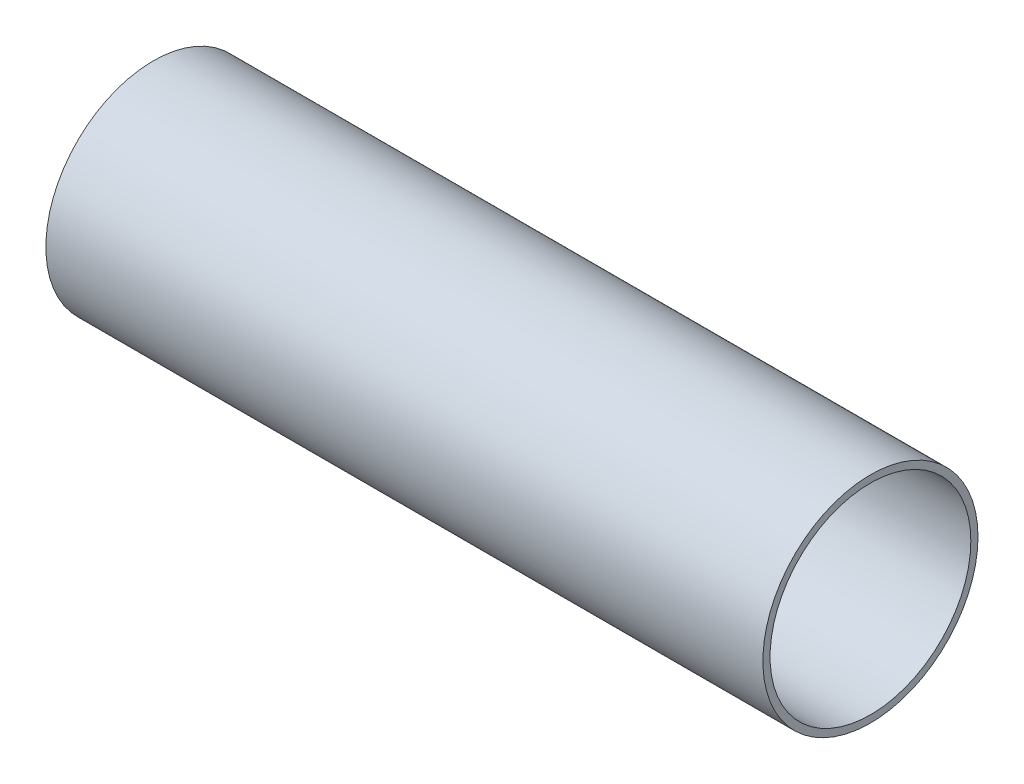
ISO-10303-21;
HEADER;
FILE_DESCRIPTION(('STEP AP214'),'2;1');
FILE_NAME('part.step','',(''),(''),'','','');
FILE_SCHEMA(('AUTOMOTIVE_DESIGN { 1 0 10303 214 1 1 1 1 }'));
ENDSEC;
DATA;
#1=APPLICATION_CONTEXT('core data for automotive mechanical design processes');
#2=APPLICATION_PROTOCOL_DEFINITION('international standard','automotive_design',2000,#1);
#3=PRODUCT_CONTEXT('',#1,'mechanical');
#4=PRODUCT('Part','Part','',(#3));
#5=PRODUCT_RELATED_PRODUCT_CATEGORY('part','',(#4));
#6=PRODUCT_DEFINITION_FORMATION('','',#4);
#7=PRODUCT_DEFINITION_CONTEXT('part definition',#1,'design');
#8=PRODUCT_DEFINITION('design','',#6,#7);
#9=PRODUCT_DEFINITION_SHAPE('','',#8);
#10=(LENGTH_UNIT() NAMED_UNIT(*) SI_UNIT(.MILLI.,.METRE.));
#11=(NAMED_UNIT(*) PLANE_ANGLE_UNIT() SI_UNIT($,.RADIAN.));
#12=(NAMED_UNIT(*) SI_UNIT($,.STERADIAN.) SOLID_ANGLE_UNIT());
#13=UNCERTAINTY_MEASURE_WITH_UNIT(LENGTH_MEASURE(1.E-05),#10,'distance_accuracy_value','');
#14=(GEOMETRIC_REPRESENTATION_CONTEXT(3) GLOBAL_UNCERTAINTY_ASSIGNED_CONTEXT((#13)) GLOBAL_UNIT_ASSIGNED_CONTEXT((#10,
#11,#12)) REPRESENTATION_CONTEXT('',''));
#15=CARTESIAN_POINT('',(0.,0.,0.));
#16=DIRECTION('',(0.,0.,1.));
#17=DIRECTION('',(1.,0.,0.));
#18=AXIS2_PLACEMENT_3D('',#15,#16,#17);
#19=CARTESIAN_POINT('',(200.,0.,0.));
#20=DIRECTION('',(-1.,0.,0.));
#21=DIRECTION('',(0.,0.,1.));
#22=AXIS2_PLACEMENT_3D('',#19,#20,#21);
#23=CYLINDRICAL_SURFACE('',#22,30.);
#24=CARTESIAN_POINT('',(200.,0.,0.));
#25=DIRECTION('',(1.,0.,0.));
#26=DIRECTION('',(0.,0.,-1.));
#27=AXIS2_PLACEMENT_3D('',#24,#25,#26);
#28=CIRCLE('',#27,30.);
#29=CARTESIAN_POINT('',(200.,0.,-30.));
#30=VERTEX_POINT('',#29);
#31=EDGE_CURVE('E10',#30,#30,#28,.T.);
#32=ORIENTED_EDGE('',*,*,#31,.F.);
#33=EDGE_LOOP('',(#32));
#34=FACE_BOUND('',#33,.T.);
#35=CARTESIAN_POINT('',(0.,0.,0.));
#36=DIRECTION('',(1.,0.,0.));
#37=DIRECTION('',(0.,0.,-1.));
#38=AXIS2_PLACEMENT_3D('',#35,#36,#37);
#39=CIRCLE('',#38,30.);
#40=CARTESIAN_POINT('',(0.,0.,-30.));
#41=VERTEX_POINT('',#40);
#42=EDGE_CURVE('E36',#41,#41,#39,.T.);
#43=ORIENTED_EDGE('',*,*,#42,.T.);
#44=EDGE_LOOP('',(#43));
#45=FACE_BOUND('',#44,.T.);
#46=ADVANCED_FACE('F33',(#34,#45),#23,.T.);
#47=CARTESIAN_POINT('',(200.,0.,0.));
#48=DIRECTION('',(1.,0.,0.));
#49=DIRECTION('',(0.,0.,-1.));
#50=AXIS2_PLACEMENT_3D('',#47,#48,#49);
#51=PLANE('',#50);
#52=CARTESIAN_POINT('',(200.,0.,0.));
#53=DIRECTION('',(1.,0.,0.));
#54=DIRECTION('',(0.,0.,-1.));
#55=AXIS2_PLACEMENT_3D('',#52,#53,#54);
#56=CIRCLE('',#55,28.);
#57=CARTESIAN_POINT('',(200.,0.,-28.));
#58=VERTEX_POINT('',#57);
#59=EDGE_CURVE('E45',#58,#58,#56,.T.);
#60=ORIENTED_EDGE('',*,*,#59,.F.);
#61=EDGE_LOOP('',(#60));
#62=FACE_BOUND('',#61,.T.);
#63=ORIENTED_EDGE('',*,*,#31,.T.);
#64=EDGE_LOOP('',(#63));
#65=FACE_BOUND('',#64,.T.);
#66=ADVANCED_FACE('F60',(#62,#65),#51,.T.);
#67=CARTESIAN_POINT('',(0.,0.,0.));
#68=DIRECTION('',(1.,0.,0.));
#69=DIRECTION('',(0.,0.,-1.));
#70=AXIS2_PLACEMENT_3D('',#67,#68,#69);
#71=PLANE('',#70);
#72=CARTESIAN_POINT('',(0.,0.,0.));
#73=DIRECTION('',(1.,0.,0.));
#74=DIRECTION('',(0.,0.,-1.));
#75=AXIS2_PLACEMENT_3D('',#72,#73,#74);
#76=CIRCLE('',#75,28.);
#77=CARTESIAN_POINT('',(0.,0.,-28.));
#78=VERTEX_POINT('',#77);
#79=EDGE_CURVE('E43',#78,#78,#76,.T.);
#80=ORIENTED_EDGE('',*,*,#79,.T.);
#81=EDGE_LOOP('',(#80));
#82=FACE_BOUND('',#81,.T.);
#83=ORIENTED_EDGE('',*,*,#42,.F.);
#84=EDGE_LOOP('',(#83));
#85=FACE_BOUND('',#84,.T.);
#86=ADVANCED_FACE('F51',(#82,#85),#71,.F.);
#87=CARTESIAN_POINT('',(0.,0.,0.));
#88=DIRECTION('',(1.,0.,0.));
#89=DIRECTION('',(0.,0.,-1.));
#90=AXIS2_PLACEMENT_3D('',#87,#88,#89);
#91=CYLINDRICAL_SURFACE('',#90,28.);
#92=ORIENTED_EDGE('',*,*,#79,.F.);
#93=EDGE_LOOP('',(#92));
#94=FACE_BOUND('',#93,.T.);
#95=ORIENTED_EDGE('',*,*,#59,.T.);
#96=EDGE_LOOP('',(#95));
#97=FACE_BOUND('',#96,.T.);
#98=ADVANCED_FACE('F54',(#94,#97),#91,.F.);
#99=CLOSED_SHELL('',(#46,#66,#86,#98));
#100=MANIFOLD_SOLID_BREP('B2',#99);
#101=ADVANCED_BREP_SHAPE_REPRESENTATION('',(#18,#100),#14);
#102=SHAPE_DEFINITION_REPRESENTATION(#9,#101);
ENDSEC;
END-ISO-10303-21;
